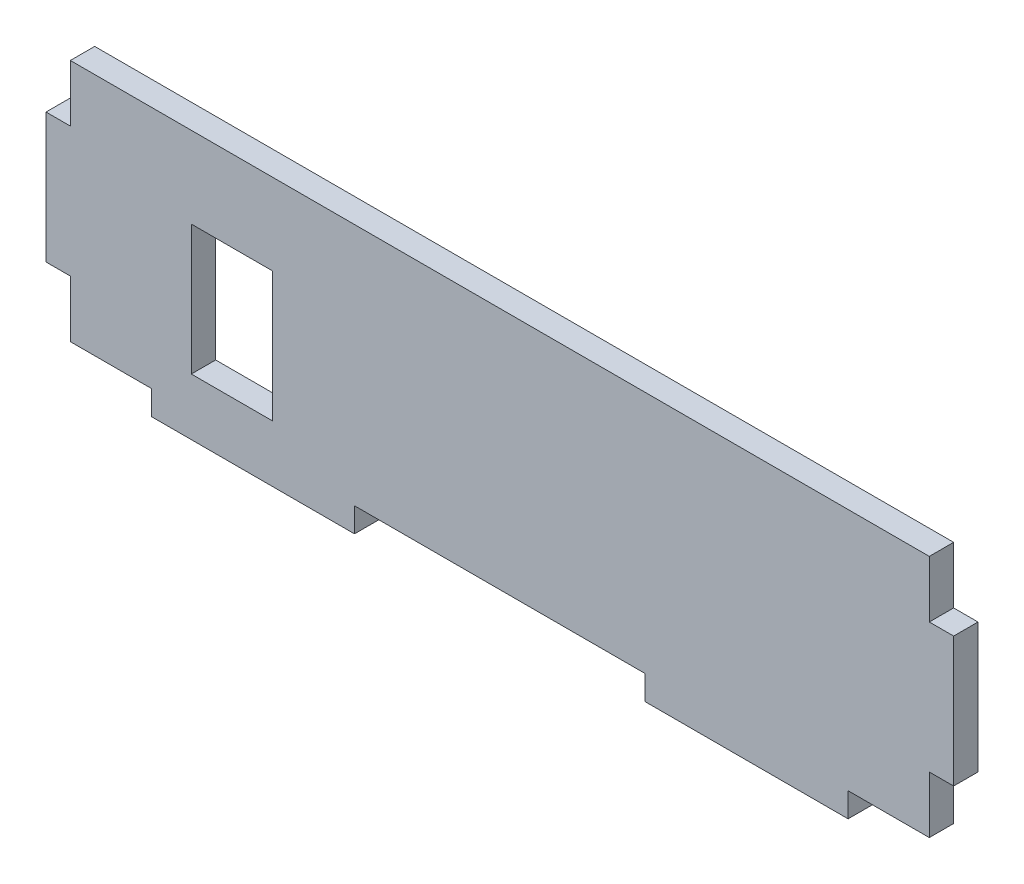
ISO-10303-21;
HEADER;
FILE_DESCRIPTION(('STEP AP214'),'2;1');
FILE_NAME('part.step','',(''),(''),'','','');
FILE_SCHEMA(('AUTOMOTIVE_DESIGN { 1 0 10303 214 1 1 1 1 }'));
ENDSEC;
DATA;
#1=APPLICATION_CONTEXT('core data for automotive mechanical design processes');
#2=APPLICATION_PROTOCOL_DEFINITION('international standard','automotive_design',2000,#1);
#3=PRODUCT_CONTEXT('',#1,'mechanical');
#4=PRODUCT('Part','Part','',(#3));
#5=PRODUCT_RELATED_PRODUCT_CATEGORY('part','',(#4));
#6=PRODUCT_DEFINITION_FORMATION('','',#4);
#7=PRODUCT_DEFINITION_CONTEXT('part definition',#1,'design');
#8=PRODUCT_DEFINITION('design','',#6,#7);
#9=PRODUCT_DEFINITION_SHAPE('','',#8);
#10=(LENGTH_UNIT() NAMED_UNIT(*) SI_UNIT(.MILLI.,.METRE.));
#11=(NAMED_UNIT(*) PLANE_ANGLE_UNIT() SI_UNIT($,.RADIAN.));
#12=(NAMED_UNIT(*) SI_UNIT($,.STERADIAN.) SOLID_ANGLE_UNIT());
#13=UNCERTAINTY_MEASURE_WITH_UNIT(LENGTH_MEASURE(1.E-05),#10,'distance_accuracy_value','');
#14=(GEOMETRIC_REPRESENTATION_CONTEXT(3) GLOBAL_UNCERTAINTY_ASSIGNED_CONTEXT((#13)) GLOBAL_UNIT_ASSIGNED_CONTEXT((#10,
#11,#12)) REPRESENTATION_CONTEXT('',''));
#15=CARTESIAN_POINT('',(0.,0.,0.));
#16=DIRECTION('',(0.,0.,1.));
#17=DIRECTION('',(1.,0.,0.));
#18=AXIS2_PLACEMENT_3D('',#15,#16,#17);
#19=CARTESIAN_POINT('',(0.,0.,3.));
#20=DIRECTION('',(0.,1.,0.));
#21=DIRECTION('',(0.,0.,1.));
#22=AXIS2_PLACEMENT_3D('',#19,#20,#21);
#23=PLANE('',#22);
#24=DIRECTION('',(1.,0.,0.));
#25=VECTOR('',#24,1.);
#26=CARTESIAN_POINT('',(0.,0.,0.));
#27=LINE('',#26,#25);
#28=CARTESIAN_POINT('',(6.50000000000001,0.,0.));
#29=VERTEX_POINT('',#28);
#30=CARTESIAN_POINT('',(16.5,0.,0.));
#31=VERTEX_POINT('',#30);
#32=EDGE_CURVE('E241',#29,#31,#27,.T.);
#33=ORIENTED_EDGE('',*,*,#32,.T.);
#34=DIRECTION('',(0.,0.,-1.));
#35=VECTOR('',#34,1.);
#36=CARTESIAN_POINT('',(16.5,0.,3.));
#37=LINE('',#36,#35);
#38=CARTESIAN_POINT('',(16.5,0.,3.));
#39=VERTEX_POINT('',#38);
#40=EDGE_CURVE('E11',#39,#31,#37,.T.);
#41=ORIENTED_EDGE('',*,*,#40,.F.);
#42=DIRECTION('',(1.,0.,0.));
#43=VECTOR('',#42,1.);
#44=CARTESIAN_POINT('',(0.,0.,3.));
#45=LINE('',#44,#43);
#46=CARTESIAN_POINT('',(6.50000000000001,0.,3.));
#47=VERTEX_POINT('',#46);
#48=EDGE_CURVE('E450',#47,#39,#45,.T.);
#49=ORIENTED_EDGE('',*,*,#48,.F.);
#50=DIRECTION('',(0.,0.,-1.));
#51=VECTOR('',#50,1.);
#52=CARTESIAN_POINT('',(6.50000000000001,0.,3.));
#53=LINE('',#52,#51);
#54=EDGE_CURVE('E296',#47,#29,#53,.T.);
#55=ORIENTED_EDGE('',*,*,#54,.T.);
#56=EDGE_LOOP('',(#33,#41,#49,#55));
#57=FACE_BOUND('',#56,.T.);
#58=ADVANCED_FACE('F35',(#57),#23,.F.);
#59=CARTESIAN_POINT('',(16.5,0.,3.));
#60=DIRECTION('',(1.,0.,0.));
#61=DIRECTION('',(0.,0.,-1.));
#62=AXIS2_PLACEMENT_3D('',#59,#60,#61);
#63=PLANE('',#62);
#64=DIRECTION('',(0.,-1.,0.));
#65=VECTOR('',#64,1.);
#66=CARTESIAN_POINT('',(16.5,0.,0.));
#67=LINE('',#66,#65);
#68=CARTESIAN_POINT('',(16.5,-3.,0.));
#69=VERTEX_POINT('',#68);
#70=EDGE_CURVE('E244',#31,#69,#67,.T.);
#71=ORIENTED_EDGE('',*,*,#70,.T.);
#72=DIRECTION('',(0.,0.,-1.));
#73=VECTOR('',#72,1.);
#74=CARTESIAN_POINT('',(16.5,-3.,3.));
#75=LINE('',#74,#73);
#76=CARTESIAN_POINT('',(16.5,-3.,3.));
#77=VERTEX_POINT('',#76);
#78=EDGE_CURVE('E45',#77,#69,#75,.T.);
#79=ORIENTED_EDGE('',*,*,#78,.F.);
#80=DIRECTION('',(0.,-1.,0.));
#81=VECTOR('',#80,1.);
#82=CARTESIAN_POINT('',(16.5,0.,3.));
#83=LINE('',#82,#81);
#84=EDGE_CURVE('E452',#39,#77,#83,.T.);
#85=ORIENTED_EDGE('',*,*,#84,.F.);
#86=ORIENTED_EDGE('',*,*,#40,.T.);
#87=EDGE_LOOP('',(#71,#79,#85,#86));
#88=FACE_BOUND('',#87,.T.);
#89=ADVANCED_FACE('F363',(#88),#63,.F.);
#90=CARTESIAN_POINT('',(0.,-3.,3.));
#91=DIRECTION('',(0.,-1.,0.));
#92=DIRECTION('',(0.,0.,-1.));
#93=AXIS2_PLACEMENT_3D('',#90,#91,#92);
#94=PLANE('',#93);
#95=DIRECTION('',(-1.,0.,0.));
#96=VECTOR('',#95,1.);
#97=CARTESIAN_POINT('',(0.,-3.,0.));
#98=LINE('',#97,#96);
#99=CARTESIAN_POINT('',(41.5,-3.,0.));
#100=VERTEX_POINT('',#99);
#101=EDGE_CURVE('E247',#100,#69,#98,.T.);
#102=ORIENTED_EDGE('',*,*,#101,.F.);
#103=DIRECTION('',(0.,0.,-1.));
#104=VECTOR('',#103,1.);
#105=CARTESIAN_POINT('',(41.5,-3.,3.));
#106=LINE('',#105,#104);
#107=CARTESIAN_POINT('',(41.5,-3.,3.));
#108=VERTEX_POINT('',#107);
#109=EDGE_CURVE('E327',#108,#100,#106,.T.);
#110=ORIENTED_EDGE('',*,*,#109,.F.);
#111=DIRECTION('',(-1.,0.,0.));
#112=VECTOR('',#111,1.);
#113=CARTESIAN_POINT('',(0.,-3.,3.));
#114=LINE('',#113,#112);
#115=EDGE_CURVE('E454',#108,#77,#114,.T.);
#116=ORIENTED_EDGE('',*,*,#115,.T.);
#117=ORIENTED_EDGE('',*,*,#78,.T.);
#118=EDGE_LOOP('',(#102,#110,#116,#117));
#119=FACE_BOUND('',#118,.T.);
#120=ADVANCED_FACE('F369',(#119),#94,.T.);
#121=CARTESIAN_POINT('',(41.5,0.,3.));
#122=DIRECTION('',(1.,0.,0.));
#123=DIRECTION('',(0.,0.,-1.));
#124=AXIS2_PLACEMENT_3D('',#121,#122,#123);
#125=PLANE('',#124);
#126=DIRECTION('',(0.,-1.,0.));
#127=VECTOR('',#126,1.);
#128=CARTESIAN_POINT('',(41.5,0.,0.));
#129=LINE('',#128,#127);
#130=CARTESIAN_POINT('',(41.5,0.,0.));
#131=VERTEX_POINT('',#130);
#132=EDGE_CURVE('E250',#131,#100,#129,.T.);
#133=ORIENTED_EDGE('',*,*,#132,.F.);
#134=DIRECTION('',(0.,0.,-1.));
#135=VECTOR('',#134,1.);
#136=CARTESIAN_POINT('',(41.5,0.,3.));
#137=LINE('',#136,#135);
#138=CARTESIAN_POINT('',(41.5,0.,3.));
#139=VERTEX_POINT('',#138);
#140=EDGE_CURVE('E325',#139,#131,#137,.T.);
#141=ORIENTED_EDGE('',*,*,#140,.F.);
#142=DIRECTION('',(0.,-1.,0.));
#143=VECTOR('',#142,1.);
#144=CARTESIAN_POINT('',(41.5,0.,3.));
#145=LINE('',#144,#143);
#146=EDGE_CURVE('E457',#139,#108,#145,.T.);
#147=ORIENTED_EDGE('',*,*,#146,.T.);
#148=ORIENTED_EDGE('',*,*,#109,.T.);
#149=EDGE_LOOP('',(#133,#141,#147,#148));
#150=FACE_BOUND('',#149,.T.);
#151=ADVANCED_FACE('F375',(#150),#125,.T.);
#152=CARTESIAN_POINT('',(0.,0.,3.));
#153=DIRECTION('',(0.,-1.,0.));
#154=DIRECTION('',(0.,0.,-1.));
#155=AXIS2_PLACEMENT_3D('',#152,#153,#154);
#156=PLANE('',#155);
#157=DIRECTION('',(-1.,0.,0.));
#158=VECTOR('',#157,1.);
#159=CARTESIAN_POINT('',(0.,0.,0.));
#160=LINE('',#159,#158);
#161=CARTESIAN_POINT('',(77.3,0.,0.));
#162=VERTEX_POINT('',#161);
#163=EDGE_CURVE('E253',#162,#131,#160,.T.);
#164=ORIENTED_EDGE('',*,*,#163,.F.);
#165=DIRECTION('',(0.,0.,-1.));
#166=VECTOR('',#165,1.);
#167=CARTESIAN_POINT('',(77.3,0.,3.));
#168=LINE('',#167,#166);
#169=CARTESIAN_POINT('',(77.3,0.,3.));
#170=VERTEX_POINT('',#169);
#171=EDGE_CURVE('E323',#170,#162,#168,.T.);
#172=ORIENTED_EDGE('',*,*,#171,.F.);
#173=DIRECTION('',(-1.,0.,0.));
#174=VECTOR('',#173,1.);
#175=CARTESIAN_POINT('',(0.,0.,3.));
#176=LINE('',#175,#174);
#177=EDGE_CURVE('E460',#170,#139,#176,.T.);
#178=ORIENTED_EDGE('',*,*,#177,.T.);
#179=ORIENTED_EDGE('',*,*,#140,.T.);
#180=EDGE_LOOP('',(#164,#172,#178,#179));
#181=FACE_BOUND('',#180,.T.);
#182=ADVANCED_FACE('F379',(#181),#156,.T.);
#183=CARTESIAN_POINT('',(77.3,0.,3.));
#184=DIRECTION('',(1.,0.,0.));
#185=DIRECTION('',(0.,0.,-1.));
#186=AXIS2_PLACEMENT_3D('',#183,#184,#185);
#187=PLANE('',#186);
#188=DIRECTION('',(0.,-1.,0.));
#189=VECTOR('',#188,1.);
#190=CARTESIAN_POINT('',(77.3,0.,0.));
#191=LINE('',#190,#189);
#192=CARTESIAN_POINT('',(77.3,-3.,0.));
#193=VERTEX_POINT('',#192);
#194=EDGE_CURVE('E256',#162,#193,#191,.T.);
#195=ORIENTED_EDGE('',*,*,#194,.T.);
#196=DIRECTION('',(0.,0.,-1.));
#197=VECTOR('',#196,1.);
#198=CARTESIAN_POINT('',(77.3,-3.,3.));
#199=LINE('',#198,#197);
#200=CARTESIAN_POINT('',(77.3,-3.,3.));
#201=VERTEX_POINT('',#200);
#202=EDGE_CURVE('E320',#201,#193,#199,.T.);
#203=ORIENTED_EDGE('',*,*,#202,.F.);
#204=DIRECTION('',(0.,-1.,0.));
#205=VECTOR('',#204,1.);
#206=CARTESIAN_POINT('',(77.3,0.,3.));
#207=LINE('',#206,#205);
#208=EDGE_CURVE('E463',#170,#201,#207,.T.);
#209=ORIENTED_EDGE('',*,*,#208,.F.);
#210=ORIENTED_EDGE('',*,*,#171,.T.);
#211=EDGE_LOOP('',(#195,#203,#209,#210));
#212=FACE_BOUND('',#211,.T.);
#213=ADVANCED_FACE('F383',(#212),#187,.F.);
#214=CARTESIAN_POINT('',(0.,-3.,3.));
#215=DIRECTION('',(0.,1.,0.));
#216=DIRECTION('',(0.,0.,1.));
#217=AXIS2_PLACEMENT_3D('',#214,#215,#216);
#218=PLANE('',#217);
#219=DIRECTION('',(1.,0.,0.));
#220=VECTOR('',#219,1.);
#221=CARTESIAN_POINT('',(0.,-3.,0.));
#222=LINE('',#221,#220);
#223=CARTESIAN_POINT('',(102.3,-3.,0.));
#224=VERTEX_POINT('',#223);
#225=EDGE_CURVE('E258',#193,#224,#222,.T.);
#226=ORIENTED_EDGE('',*,*,#225,.T.);
#227=DIRECTION('',(0.,0.,-1.));
#228=VECTOR('',#227,1.);
#229=CARTESIAN_POINT('',(102.3,-3.,3.));
#230=LINE('',#229,#228);
#231=CARTESIAN_POINT('',(102.3,-3.,3.));
#232=VERTEX_POINT('',#231);
#233=EDGE_CURVE('E318',#232,#224,#230,.T.);
#234=ORIENTED_EDGE('',*,*,#233,.F.);
#235=DIRECTION('',(1.,0.,0.));
#236=VECTOR('',#235,1.);
#237=CARTESIAN_POINT('',(0.,-3.,3.));
#238=LINE('',#237,#236);
#239=EDGE_CURVE('E465',#201,#232,#238,.T.);
#240=ORIENTED_EDGE('',*,*,#239,.F.);
#241=ORIENTED_EDGE('',*,*,#202,.T.);
#242=EDGE_LOOP('',(#226,#234,#240,#241));
#243=FACE_BOUND('',#242,.T.);
#244=ADVANCED_FACE('F387',(#243),#218,.F.);
#245=CARTESIAN_POINT('',(102.3,0.,3.));
#246=DIRECTION('',(1.,0.,0.));
#247=DIRECTION('',(0.,0.,-1.));
#248=AXIS2_PLACEMENT_3D('',#245,#246,#247);
#249=PLANE('',#248);
#250=DIRECTION('',(0.,-1.,0.));
#251=VECTOR('',#250,1.);
#252=CARTESIAN_POINT('',(102.3,0.,0.));
#253=LINE('',#252,#251);
#254=CARTESIAN_POINT('',(102.3,0.,0.));
#255=VERTEX_POINT('',#254);
#256=EDGE_CURVE('E261',#255,#224,#253,.T.);
#257=ORIENTED_EDGE('',*,*,#256,.F.);
#258=DIRECTION('',(0.,0.,-1.));
#259=VECTOR('',#258,1.);
#260=CARTESIAN_POINT('',(102.3,0.,3.));
#261=LINE('',#260,#259);
#262=CARTESIAN_POINT('',(102.3,0.,3.));
#263=VERTEX_POINT('',#262);
#264=EDGE_CURVE('E316',#263,#255,#261,.T.);
#265=ORIENTED_EDGE('',*,*,#264,.F.);
#266=DIRECTION('',(0.,-1.,0.));
#267=VECTOR('',#266,1.);
#268=CARTESIAN_POINT('',(102.3,0.,3.));
#269=LINE('',#268,#267);
#270=EDGE_CURVE('E467',#263,#232,#269,.T.);
#271=ORIENTED_EDGE('',*,*,#270,.T.);
#272=ORIENTED_EDGE('',*,*,#233,.T.);
#273=EDGE_LOOP('',(#257,#265,#271,#272));
#274=FACE_BOUND('',#273,.T.);
#275=ADVANCED_FACE('F391',(#274),#249,.T.);
#276=CARTESIAN_POINT('',(0.,0.,3.));
#277=DIRECTION('',(0.,1.,0.));
#278=DIRECTION('',(0.,0.,1.));
#279=AXIS2_PLACEMENT_3D('',#276,#277,#278);
#280=PLANE('',#279);
#281=DIRECTION('',(1.,0.,0.));
#282=VECTOR('',#281,1.);
#283=CARTESIAN_POINT('',(0.,0.,0.));
#284=LINE('',#283,#282);
#285=CARTESIAN_POINT('',(112.3,0.,0.));
#286=VERTEX_POINT('',#285);
#287=EDGE_CURVE('E264',#255,#286,#284,.T.);
#288=ORIENTED_EDGE('',*,*,#287,.T.);
#289=DIRECTION('',(0.,0.,-1.));
#290=VECTOR('',#289,1.);
#291=CARTESIAN_POINT('',(112.3,0.,3.));
#292=LINE('',#291,#290);
#293=CARTESIAN_POINT('',(112.3,0.,3.));
#294=VERTEX_POINT('',#293);
#295=EDGE_CURVE('E314',#294,#286,#292,.T.);
#296=ORIENTED_EDGE('',*,*,#295,.F.);
#297=DIRECTION('',(1.,0.,0.));
#298=VECTOR('',#297,1.);
#299=CARTESIAN_POINT('',(0.,0.,3.));
#300=LINE('',#299,#298);
#301=EDGE_CURVE('E470',#263,#294,#300,.T.);
#302=ORIENTED_EDGE('',*,*,#301,.F.);
#303=ORIENTED_EDGE('',*,*,#264,.T.);
#304=EDGE_LOOP('',(#288,#296,#302,#303));
#305=FACE_BOUND('',#304,.T.);
#306=ADVANCED_FACE('F395',(#305),#280,.F.);
#307=CARTESIAN_POINT('',(112.3,0.,3.));
#308=DIRECTION('',(1.,0.,0.));
#309=DIRECTION('',(0.,0.,-1.));
#310=AXIS2_PLACEMENT_3D('',#307,#308,#309);
#311=PLANE('',#310);
#312=DIRECTION('',(0.,-1.,0.));
#313=VECTOR('',#312,1.);
#314=CARTESIAN_POINT('',(112.3,0.,0.));
#315=LINE('',#314,#313);
#316=CARTESIAN_POINT('',(112.3,7.,0.));
#317=VERTEX_POINT('',#316);
#318=EDGE_CURVE('E267',#317,#286,#315,.T.);
#319=ORIENTED_EDGE('',*,*,#318,.F.);
#320=DIRECTION('',(0.,0.,-1.));
#321=VECTOR('',#320,1.);
#322=CARTESIAN_POINT('',(112.3,7.,3.));
#323=LINE('',#322,#321);
#324=CARTESIAN_POINT('',(112.3,7.,3.));
#325=VERTEX_POINT('',#324);
#326=EDGE_CURVE('E312',#325,#317,#323,.T.);
#327=ORIENTED_EDGE('',*,*,#326,.F.);
#328=DIRECTION('',(0.,-1.,0.));
#329=VECTOR('',#328,1.);
#330=CARTESIAN_POINT('',(112.3,0.,3.));
#331=LINE('',#330,#329);
#332=EDGE_CURVE('E472',#325,#294,#331,.T.);
#333=ORIENTED_EDGE('',*,*,#332,.T.);
#334=ORIENTED_EDGE('',*,*,#295,.T.);
#335=EDGE_LOOP('',(#319,#327,#333,#334));
#336=FACE_BOUND('',#335,.T.);
#337=ADVANCED_FACE('F399',(#336),#311,.T.);
#338=CARTESIAN_POINT('',(0.,7.,3.));
#339=DIRECTION('',(0.,1.,0.));
#340=DIRECTION('',(0.,0.,1.));
#341=AXIS2_PLACEMENT_3D('',#338,#339,#340);
#342=PLANE('',#341);
#343=DIRECTION('',(1.,0.,0.));
#344=VECTOR('',#343,1.);
#345=CARTESIAN_POINT('',(0.,7.,0.));
#346=LINE('',#345,#344);
#347=CARTESIAN_POINT('',(115.3,7.,0.));
#348=VERTEX_POINT('',#347);
#349=EDGE_CURVE('E270',#317,#348,#346,.T.);
#350=ORIENTED_EDGE('',*,*,#349,.T.);
#351=DIRECTION('',(0.,0.,-1.));
#352=VECTOR('',#351,1.);
#353=CARTESIAN_POINT('',(115.3,7.,3.));
#354=LINE('',#353,#352);
#355=CARTESIAN_POINT('',(115.3,7.,3.));
#356=VERTEX_POINT('',#355);
#357=EDGE_CURVE('E310',#356,#348,#354,.T.);
#358=ORIENTED_EDGE('',*,*,#357,.F.);
#359=DIRECTION('',(1.,0.,0.));
#360=VECTOR('',#359,1.);
#361=CARTESIAN_POINT('',(0.,7.,3.));
#362=LINE('',#361,#360);
#363=EDGE_CURVE('E475',#325,#356,#362,.T.);
#364=ORIENTED_EDGE('',*,*,#363,.F.);
#365=ORIENTED_EDGE('',*,*,#326,.T.);
#366=EDGE_LOOP('',(#350,#358,#364,#365));
#367=FACE_BOUND('',#366,.T.);
#368=ADVANCED_FACE('F403',(#367),#342,.F.);
#369=CARTESIAN_POINT('',(115.3,0.,3.));
#370=DIRECTION('',(1.,0.,0.));
#371=DIRECTION('',(0.,0.,-1.));
#372=AXIS2_PLACEMENT_3D('',#369,#370,#371);
#373=PLANE('',#372);
#374=DIRECTION('',(0.,-1.,0.));
#375=VECTOR('',#374,1.);
#376=CARTESIAN_POINT('',(115.3,0.,0.));
#377=LINE('',#376,#375);
#378=CARTESIAN_POINT('',(115.3,23.,0.));
#379=VERTEX_POINT('',#378);
#380=EDGE_CURVE('E273',#379,#348,#377,.T.);
#381=ORIENTED_EDGE('',*,*,#380,.F.);
#382=DIRECTION('',(0.,0.,-1.));
#383=VECTOR('',#382,1.);
#384=CARTESIAN_POINT('',(115.3,23.,3.));
#385=LINE('',#384,#383);
#386=CARTESIAN_POINT('',(115.3,23.,3.));
#387=VERTEX_POINT('',#386);
#388=EDGE_CURVE('E308',#387,#379,#385,.T.);
#389=ORIENTED_EDGE('',*,*,#388,.F.);
#390=DIRECTION('',(0.,-1.,0.));
#391=VECTOR('',#390,1.);
#392=CARTESIAN_POINT('',(115.3,0.,3.));
#393=LINE('',#392,#391);
#394=EDGE_CURVE('E477',#387,#356,#393,.T.);
#395=ORIENTED_EDGE('',*,*,#394,.T.);
#396=ORIENTED_EDGE('',*,*,#357,.T.);
#397=EDGE_LOOP('',(#381,#389,#395,#396));
#398=FACE_BOUND('',#397,.T.);
#399=ADVANCED_FACE('F407',(#398),#373,.T.);
#400=CARTESIAN_POINT('',(0.,23.,3.));
#401=DIRECTION('',(0.,1.,0.));
#402=DIRECTION('',(0.,0.,1.));
#403=AXIS2_PLACEMENT_3D('',#400,#401,#402);
#404=PLANE('',#403);
#405=DIRECTION('',(1.,0.,0.));
#406=VECTOR('',#405,1.);
#407=CARTESIAN_POINT('',(0.,23.,0.));
#408=LINE('',#407,#406);
#409=CARTESIAN_POINT('',(112.3,23.,0.));
#410=VERTEX_POINT('',#409);
#411=EDGE_CURVE('E276',#410,#379,#408,.T.);
#412=ORIENTED_EDGE('',*,*,#411,.F.);
#413=DIRECTION('',(0.,0.,-1.));
#414=VECTOR('',#413,1.);
#415=CARTESIAN_POINT('',(112.3,23.,3.));
#416=LINE('',#415,#414);
#417=CARTESIAN_POINT('',(112.3,23.,3.));
#418=VERTEX_POINT('',#417);
#419=EDGE_CURVE('E306',#418,#410,#416,.T.);
#420=ORIENTED_EDGE('',*,*,#419,.F.);
#421=DIRECTION('',(1.,0.,0.));
#422=VECTOR('',#421,1.);
#423=CARTESIAN_POINT('',(0.,23.,3.));
#424=LINE('',#423,#422);
#425=EDGE_CURVE('E480',#418,#387,#424,.T.);
#426=ORIENTED_EDGE('',*,*,#425,.T.);
#427=ORIENTED_EDGE('',*,*,#388,.T.);
#428=EDGE_LOOP('',(#412,#420,#426,#427));
#429=FACE_BOUND('',#428,.T.);
#430=ADVANCED_FACE('F411',(#429),#404,.T.);
#431=CARTESIAN_POINT('',(112.3,0.,3.));
#432=DIRECTION('',(-1.,0.,0.));
#433=DIRECTION('',(0.,0.,1.));
#434=AXIS2_PLACEMENT_3D('',#431,#432,#433);
#435=PLANE('',#434);
#436=DIRECTION('',(0.,1.,0.));
#437=VECTOR('',#436,1.);
#438=CARTESIAN_POINT('',(112.3,0.,0.));
#439=LINE('',#438,#437);
#440=CARTESIAN_POINT('',(112.3,30.,0.));
#441=VERTEX_POINT('',#440);
#442=EDGE_CURVE('E279',#410,#441,#439,.T.);
#443=ORIENTED_EDGE('',*,*,#442,.T.);
#444=DIRECTION('',(0.,0.,-1.));
#445=VECTOR('',#444,1.);
#446=CARTESIAN_POINT('',(112.3,30.,3.));
#447=LINE('',#446,#445);
#448=CARTESIAN_POINT('',(112.3,30.,3.));
#449=VERTEX_POINT('',#448);
#450=EDGE_CURVE('E304',#449,#441,#447,.T.);
#451=ORIENTED_EDGE('',*,*,#450,.F.);
#452=DIRECTION('',(0.,1.,0.));
#453=VECTOR('',#452,1.);
#454=CARTESIAN_POINT('',(112.3,0.,3.));
#455=LINE('',#454,#453);
#456=EDGE_CURVE('E483',#418,#449,#455,.T.);
#457=ORIENTED_EDGE('',*,*,#456,.F.);
#458=ORIENTED_EDGE('',*,*,#419,.T.);
#459=EDGE_LOOP('',(#443,#451,#457,#458));
#460=FACE_BOUND('',#459,.T.);
#461=ADVANCED_FACE('F415',(#460),#435,.F.);
#462=CARTESIAN_POINT('',(0.,30.,3.));
#463=DIRECTION('',(0.,1.,0.));
#464=DIRECTION('',(0.,0.,1.));
#465=AXIS2_PLACEMENT_3D('',#462,#463,#464);
#466=PLANE('',#465);
#467=DIRECTION('',(1.,0.,0.));
#468=VECTOR('',#467,1.);
#469=CARTESIAN_POINT('',(0.,30.,0.));
#470=LINE('',#469,#468);
#471=CARTESIAN_POINT('',(6.50000000000001,30.,0.));
#472=VERTEX_POINT('',#471);
#473=EDGE_CURVE('E282',#472,#441,#470,.T.);
#474=ORIENTED_EDGE('',*,*,#473,.F.);
#475=DIRECTION('',(0.,0.,-1.));
#476=VECTOR('',#475,1.);
#477=CARTESIAN_POINT('',(6.50000000000001,30.,3.));
#478=LINE('',#477,#476);
#479=CARTESIAN_POINT('',(6.50000000000001,30.,3.));
#480=VERTEX_POINT('',#479);
#481=EDGE_CURVE('E302',#480,#472,#478,.T.);
#482=ORIENTED_EDGE('',*,*,#481,.F.);
#483=DIRECTION('',(1.,0.,0.));
#484=VECTOR('',#483,1.);
#485=CARTESIAN_POINT('',(0.,30.,3.));
#486=LINE('',#485,#484);
#487=EDGE_CURVE('E485',#480,#449,#486,.T.);
#488=ORIENTED_EDGE('',*,*,#487,.T.);
#489=ORIENTED_EDGE('',*,*,#450,.T.);
#490=EDGE_LOOP('',(#474,#482,#488,#489));
#491=FACE_BOUND('',#490,.T.);
#492=ADVANCED_FACE('F419',(#491),#466,.T.);
#493=CARTESIAN_POINT('',(6.50000000000001,0.,3.));
#494=DIRECTION('',(-1.,0.,0.));
#495=DIRECTION('',(0.,0.,1.));
#496=AXIS2_PLACEMENT_3D('',#493,#494,#495);
#497=PLANE('',#496);
#498=DIRECTION('',(0.,1.,0.));
#499=VECTOR('',#498,1.);
#500=CARTESIAN_POINT('',(6.50000000000001,0.,0.));
#501=LINE('',#500,#499);
#502=CARTESIAN_POINT('',(6.50000000000001,23.,0.));
#503=VERTEX_POINT('',#502);
#504=EDGE_CURVE('E285',#503,#472,#501,.T.);
#505=ORIENTED_EDGE('',*,*,#504,.F.);
#506=DIRECTION('',(0.,0.,-1.));
#507=VECTOR('',#506,1.);
#508=CARTESIAN_POINT('',(6.50000000000001,23.,3.));
#509=LINE('',#508,#507);
#510=CARTESIAN_POINT('',(6.50000000000001,23.,3.));
#511=VERTEX_POINT('',#510);
#512=EDGE_CURVE('E300',#511,#503,#509,.T.);
#513=ORIENTED_EDGE('',*,*,#512,.F.);
#514=DIRECTION('',(0.,1.,0.));
#515=VECTOR('',#514,1.);
#516=CARTESIAN_POINT('',(6.50000000000001,0.,3.));
#517=LINE('',#516,#515);
#518=EDGE_CURVE('E488',#511,#480,#517,.T.);
#519=ORIENTED_EDGE('',*,*,#518,.T.);
#520=ORIENTED_EDGE('',*,*,#481,.T.);
#521=EDGE_LOOP('',(#505,#513,#519,#520));
#522=FACE_BOUND('',#521,.T.);
#523=ADVANCED_FACE('F423',(#522),#497,.T.);
#524=CARTESIAN_POINT('',(0.,23.,3.));
#525=DIRECTION('',(0.,-1.,0.));
#526=DIRECTION('',(0.,0.,-1.));
#527=AXIS2_PLACEMENT_3D('',#524,#525,#526);
#528=PLANE('',#527);
#529=DIRECTION('',(-1.,0.,0.));
#530=VECTOR('',#529,1.);
#531=CARTESIAN_POINT('',(0.,23.,0.));
#532=LINE('',#531,#530);
#533=CARTESIAN_POINT('',(3.50000000000001,23.,0.));
#534=VERTEX_POINT('',#533);
#535=EDGE_CURVE('E288',#503,#534,#532,.T.);
#536=ORIENTED_EDGE('',*,*,#535,.T.);
#537=DIRECTION('',(0.,0.,-1.));
#538=VECTOR('',#537,1.);
#539=CARTESIAN_POINT('',(3.50000000000001,23.,3.));
#540=LINE('',#539,#538);
#541=CARTESIAN_POINT('',(3.50000000000001,23.,3.));
#542=VERTEX_POINT('',#541);
#543=EDGE_CURVE('E215',#542,#534,#540,.T.);
#544=ORIENTED_EDGE('',*,*,#543,.F.);
#545=DIRECTION('',(-1.,0.,0.));
#546=VECTOR('',#545,1.);
#547=CARTESIAN_POINT('',(0.,23.,3.));
#548=LINE('',#547,#546);
#549=EDGE_CURVE('E221',#511,#542,#548,.T.);
#550=ORIENTED_EDGE('',*,*,#549,.F.);
#551=ORIENTED_EDGE('',*,*,#512,.T.);
#552=EDGE_LOOP('',(#536,#544,#550,#551));
#553=FACE_BOUND('',#552,.T.);
#554=ADVANCED_FACE('F427',(#553),#528,.F.);
#555=CARTESIAN_POINT('',(3.50000000000001,0.,3.));
#556=DIRECTION('',(-1.,0.,0.));
#557=DIRECTION('',(0.,0.,1.));
#558=AXIS2_PLACEMENT_3D('',#555,#556,#557);
#559=PLANE('',#558);
#560=DIRECTION('',(0.,1.,0.));
#561=VECTOR('',#560,1.);
#562=CARTESIAN_POINT('',(3.50000000000001,0.,0.));
#563=LINE('',#562,#561);
#564=CARTESIAN_POINT('',(3.50000000000001,7.,0.));
#565=VERTEX_POINT('',#564);
#566=EDGE_CURVE('E210',#565,#534,#563,.T.);
#567=ORIENTED_EDGE('',*,*,#566,.F.);
#568=DIRECTION('',(0.,0.,-1.));
#569=VECTOR('',#568,1.);
#570=CARTESIAN_POINT('',(3.50000000000001,7.,3.));
#571=LINE('',#570,#569);
#572=CARTESIAN_POINT('',(3.50000000000001,7.,3.));
#573=VERTEX_POINT('',#572);
#574=EDGE_CURVE('E205',#573,#565,#571,.T.);
#575=ORIENTED_EDGE('',*,*,#574,.F.);
#576=DIRECTION('',(0.,1.,0.));
#577=VECTOR('',#576,1.);
#578=CARTESIAN_POINT('',(3.50000000000001,0.,3.));
#579=LINE('',#578,#577);
#580=EDGE_CURVE('E208',#573,#542,#579,.T.);
#581=ORIENTED_EDGE('',*,*,#580,.T.);
#582=ORIENTED_EDGE('',*,*,#543,.T.);
#583=EDGE_LOOP('',(#567,#575,#581,#582));
#584=FACE_BOUND('',#583,.T.);
#585=ADVANCED_FACE('F207',(#584),#559,.T.);
#586=CARTESIAN_POINT('',(0.,7.,3.));
#587=DIRECTION('',(0.,-1.,0.));
#588=DIRECTION('',(0.,0.,-1.));
#589=AXIS2_PLACEMENT_3D('',#586,#587,#588);
#590=PLANE('',#589);
#591=DIRECTION('',(-1.,0.,0.));
#592=VECTOR('',#591,1.);
#593=CARTESIAN_POINT('',(0.,7.,0.));
#594=LINE('',#593,#592);
#595=CARTESIAN_POINT('',(6.50000000000001,7.,0.));
#596=VERTEX_POINT('',#595);
#597=EDGE_CURVE('E292',#596,#565,#594,.T.);
#598=ORIENTED_EDGE('',*,*,#597,.F.);
#599=DIRECTION('',(0.,0.,-1.));
#600=VECTOR('',#599,1.);
#601=CARTESIAN_POINT('',(6.50000000000001,7.,3.));
#602=LINE('',#601,#600);
#603=CARTESIAN_POINT('',(6.50000000000001,7.,3.));
#604=VERTEX_POINT('',#603);
#605=EDGE_CURVE('E130',#604,#596,#602,.T.);
#606=ORIENTED_EDGE('',*,*,#605,.F.);
#607=DIRECTION('',(-1.,0.,0.));
#608=VECTOR('',#607,1.);
#609=CARTESIAN_POINT('',(0.,7.,3.));
#610=LINE('',#609,#608);
#611=EDGE_CURVE('E218',#604,#573,#610,.T.);
#612=ORIENTED_EDGE('',*,*,#611,.T.);
#613=ORIENTED_EDGE('',*,*,#574,.T.);
#614=EDGE_LOOP('',(#598,#606,#612,#613));
#615=FACE_BOUND('',#614,.T.);
#616=ADVANCED_FACE('F224',(#615),#590,.T.);
#617=CARTESIAN_POINT('',(0.,4.,3.));
#618=DIRECTION('',(0.,1.,0.));
#619=DIRECTION('',(0.,0.,1.));
#620=AXIS2_PLACEMENT_3D('',#617,#618,#619);
#621=PLANE('',#620);
#622=DIRECTION('',(1.,0.,0.));
#623=VECTOR('',#622,1.);
#624=CARTESIAN_POINT('',(0.,4.,0.));
#625=LINE('',#624,#623);
#626=CARTESIAN_POINT('',(21.4,4.,0.));
#627=VERTEX_POINT('',#626);
#628=CARTESIAN_POINT('',(31.4,4.,0.));
#629=VERTEX_POINT('',#628);
#630=EDGE_CURVE('E230',#627,#629,#625,.T.);
#631=ORIENTED_EDGE('',*,*,#630,.F.);
#632=DIRECTION('',(0.,0.,-1.));
#633=VECTOR('',#632,1.);
#634=CARTESIAN_POINT('',(21.4,4.,3.));
#635=LINE('',#634,#633);
#636=CARTESIAN_POINT('',(21.4,4.,3.));
#637=VERTEX_POINT('',#636);
#638=EDGE_CURVE('E39',#637,#627,#635,.T.);
#639=ORIENTED_EDGE('',*,*,#638,.F.);
#640=DIRECTION('',(1.,0.,0.));
#641=VECTOR('',#640,1.);
#642=CARTESIAN_POINT('',(0.,4.,3.));
#643=LINE('',#642,#641);
#644=CARTESIAN_POINT('',(31.4,4.,3.));
#645=VERTEX_POINT('',#644);
#646=EDGE_CURVE('E295',#637,#645,#643,.T.);
#647=ORIENTED_EDGE('',*,*,#646,.T.);
#648=DIRECTION('',(0.,0.,-1.));
#649=VECTOR('',#648,1.);
#650=CARTESIAN_POINT('',(31.4,4.,3.));
#651=LINE('',#650,#649);
#652=EDGE_CURVE('E226',#645,#629,#651,.T.);
#653=ORIENTED_EDGE('',*,*,#652,.T.);
#654=EDGE_LOOP('',(#631,#639,#647,#653));
#655=FACE_BOUND('',#654,.T.);
#656=ADVANCED_FACE('F37',(#655),#621,.T.);
#657=CARTESIAN_POINT('',(21.4,0.,3.));
#658=DIRECTION('',(-1.,0.,0.));
#659=DIRECTION('',(0.,0.,1.));
#660=AXIS2_PLACEMENT_3D('',#657,#658,#659);
#661=PLANE('',#660);
#662=DIRECTION('',(0.,1.,0.));
#663=VECTOR('',#662,1.);
#664=CARTESIAN_POINT('',(21.4,0.,0.));
#665=LINE('',#664,#663);
#666=CARTESIAN_POINT('',(21.4,20.,0.));
#667=VERTEX_POINT('',#666);
#668=EDGE_CURVE('E233',#627,#667,#665,.T.);
#669=ORIENTED_EDGE('',*,*,#668,.T.);
#670=DIRECTION('',(0.,0.,-1.));
#671=VECTOR('',#670,1.);
#672=CARTESIAN_POINT('',(21.4,20.,3.));
#673=LINE('',#672,#671);
#674=CARTESIAN_POINT('',(21.4,20.,3.));
#675=VERTEX_POINT('',#674);
#676=EDGE_CURVE('E332',#675,#667,#673,.T.);
#677=ORIENTED_EDGE('',*,*,#676,.F.);
#678=DIRECTION('',(0.,1.,0.));
#679=VECTOR('',#678,1.);
#680=CARTESIAN_POINT('',(21.4,0.,3.));
#681=LINE('',#680,#679);
#682=EDGE_CURVE('E341',#637,#675,#681,.T.);
#683=ORIENTED_EDGE('',*,*,#682,.F.);
#684=ORIENTED_EDGE('',*,*,#638,.T.);
#685=EDGE_LOOP('',(#669,#677,#683,#684));
#686=FACE_BOUND('',#685,.T.);
#687=ADVANCED_FACE('F340',(#686),#661,.F.);
#688=CARTESIAN_POINT('',(0.,20.,3.));
#689=DIRECTION('',(0.,1.,0.));
#690=DIRECTION('',(0.,0.,1.));
#691=AXIS2_PLACEMENT_3D('',#688,#689,#690);
#692=PLANE('',#691);
#693=DIRECTION('',(1.,0.,0.));
#694=VECTOR('',#693,1.);
#695=CARTESIAN_POINT('',(0.,20.,0.));
#696=LINE('',#695,#694);
#697=CARTESIAN_POINT('',(31.4,20.,0.));
#698=VERTEX_POINT('',#697);
#699=EDGE_CURVE('E235',#667,#698,#696,.T.);
#700=ORIENTED_EDGE('',*,*,#699,.T.);
#701=DIRECTION('',(0.,0.,-1.));
#702=VECTOR('',#701,1.);
#703=CARTESIAN_POINT('',(31.4,20.,3.));
#704=LINE('',#703,#702);
#705=CARTESIAN_POINT('',(31.4,20.,3.));
#706=VERTEX_POINT('',#705);
#707=EDGE_CURVE('E331',#706,#698,#704,.T.);
#708=ORIENTED_EDGE('',*,*,#707,.F.);
#709=DIRECTION('',(1.,0.,0.));
#710=VECTOR('',#709,1.);
#711=CARTESIAN_POINT('',(0.,20.,3.));
#712=LINE('',#711,#710);
#713=EDGE_CURVE('E445',#675,#706,#712,.T.);
#714=ORIENTED_EDGE('',*,*,#713,.F.);
#715=ORIENTED_EDGE('',*,*,#676,.T.);
#716=EDGE_LOOP('',(#700,#708,#714,#715));
#717=FACE_BOUND('',#716,.T.);
#718=ADVANCED_FACE('F353',(#717),#692,.F.);
#719=CARTESIAN_POINT('',(31.4,0.,3.));
#720=DIRECTION('',(-1.,0.,0.));
#721=DIRECTION('',(0.,0.,1.));
#722=AXIS2_PLACEMENT_3D('',#719,#720,#721);
#723=PLANE('',#722);
#724=DIRECTION('',(0.,1.,0.));
#725=VECTOR('',#724,1.);
#726=CARTESIAN_POINT('',(31.4,0.,0.));
#727=LINE('',#726,#725);
#728=EDGE_CURVE('E238',#629,#698,#727,.T.);
#729=ORIENTED_EDGE('',*,*,#728,.F.);
#730=ORIENTED_EDGE('',*,*,#652,.F.);
#731=DIRECTION('',(0.,1.,0.));
#732=VECTOR('',#731,1.);
#733=CARTESIAN_POINT('',(31.4,0.,3.));
#734=LINE('',#733,#732);
#735=EDGE_CURVE('E351',#645,#706,#734,.T.);
#736=ORIENTED_EDGE('',*,*,#735,.T.);
#737=ORIENTED_EDGE('',*,*,#707,.T.);
#738=EDGE_LOOP('',(#729,#730,#736,#737));
#739=FACE_BOUND('',#738,.T.);
#740=ADVANCED_FACE('F350',(#739),#723,.T.);
#741=CARTESIAN_POINT('',(6.50000000000001,0.,3.));
#742=DIRECTION('',(1.,0.,0.));
#743=DIRECTION('',(0.,0.,-1.));
#744=AXIS2_PLACEMENT_3D('',#741,#742,#743);
#745=PLANE('',#744);
#746=DIRECTION('',(0.,-1.,0.));
#747=VECTOR('',#746,1.);
#748=CARTESIAN_POINT('',(6.50000000000001,0.,0.));
#749=LINE('',#748,#747);
#750=EDGE_CURVE('E133',#596,#29,#749,.T.);
#751=ORIENTED_EDGE('',*,*,#750,.T.);
#752=ORIENTED_EDGE('',*,*,#54,.F.);
#753=DIRECTION('',(0.,-1.,0.));
#754=VECTOR('',#753,1.);
#755=CARTESIAN_POINT('',(6.50000000000001,0.,3.));
#756=LINE('',#755,#754);
#757=EDGE_CURVE('E54',#604,#47,#756,.T.);
#758=ORIENTED_EDGE('',*,*,#757,.F.);
#759=ORIENTED_EDGE('',*,*,#605,.T.);
#760=EDGE_LOOP('',(#751,#752,#758,#759));
#761=FACE_BOUND('',#760,.T.);
#762=ADVANCED_FACE('F360',(#761),#745,.F.);
#763=CARTESIAN_POINT('',(0.,0.,3.));
#764=DIRECTION('',(0.,0.,1.));
#765=DIRECTION('',(1.,0.,0.));
#766=AXIS2_PLACEMENT_3D('',#763,#764,#765);
#767=PLANE('',#766);
#768=ORIENTED_EDGE('',*,*,#646,.F.);
#769=ORIENTED_EDGE('',*,*,#682,.T.);
#770=ORIENTED_EDGE('',*,*,#713,.T.);
#771=ORIENTED_EDGE('',*,*,#735,.F.);
#772=EDGE_LOOP('',(#768,#769,#770,#771));
#773=FACE_BOUND('',#772,.T.);
#774=ORIENTED_EDGE('',*,*,#48,.T.);
#775=ORIENTED_EDGE('',*,*,#84,.T.);
#776=ORIENTED_EDGE('',*,*,#115,.F.);
#777=ORIENTED_EDGE('',*,*,#146,.F.);
#778=ORIENTED_EDGE('',*,*,#177,.F.);
#779=ORIENTED_EDGE('',*,*,#208,.T.);
#780=ORIENTED_EDGE('',*,*,#239,.T.);
#781=ORIENTED_EDGE('',*,*,#270,.F.);
#782=ORIENTED_EDGE('',*,*,#301,.T.);
#783=ORIENTED_EDGE('',*,*,#332,.F.);
#784=ORIENTED_EDGE('',*,*,#363,.T.);
#785=ORIENTED_EDGE('',*,*,#394,.F.);
#786=ORIENTED_EDGE('',*,*,#425,.F.);
#787=ORIENTED_EDGE('',*,*,#456,.T.);
#788=ORIENTED_EDGE('',*,*,#487,.F.);
#789=ORIENTED_EDGE('',*,*,#518,.F.);
#790=ORIENTED_EDGE('',*,*,#549,.T.);
#791=ORIENTED_EDGE('',*,*,#580,.F.);
#792=ORIENTED_EDGE('',*,*,#611,.F.);
#793=ORIENTED_EDGE('',*,*,#757,.T.);
#794=EDGE_LOOP('',(#774,#775,#776,#777,#778,#779,#780,#781,#782,#783,#784,#785,#786,#787,#788,
#789,#790,#791,#792,#793));
#795=FACE_BOUND('',#794,.T.);
#796=ADVANCED_FACE('F217',(#773,#795),#767,.T.);
#797=CARTESIAN_POINT('',(0.,0.,0.));
#798=DIRECTION('',(0.,0.,1.));
#799=DIRECTION('',(1.,0.,0.));
#800=AXIS2_PLACEMENT_3D('',#797,#798,#799);
#801=PLANE('',#800);
#802=ORIENTED_EDGE('',*,*,#630,.T.);
#803=ORIENTED_EDGE('',*,*,#728,.T.);
#804=ORIENTED_EDGE('',*,*,#699,.F.);
#805=ORIENTED_EDGE('',*,*,#668,.F.);
#806=EDGE_LOOP('',(#802,#803,#804,#805));
#807=FACE_BOUND('',#806,.T.);
#808=ORIENTED_EDGE('',*,*,#32,.F.);
#809=ORIENTED_EDGE('',*,*,#750,.F.);
#810=ORIENTED_EDGE('',*,*,#597,.T.);
#811=ORIENTED_EDGE('',*,*,#566,.T.);
#812=ORIENTED_EDGE('',*,*,#535,.F.);
#813=ORIENTED_EDGE('',*,*,#504,.T.);
#814=ORIENTED_EDGE('',*,*,#473,.T.);
#815=ORIENTED_EDGE('',*,*,#442,.F.);
#816=ORIENTED_EDGE('',*,*,#411,.T.);
#817=ORIENTED_EDGE('',*,*,#380,.T.);
#818=ORIENTED_EDGE('',*,*,#349,.F.);
#819=ORIENTED_EDGE('',*,*,#318,.T.);
#820=ORIENTED_EDGE('',*,*,#287,.F.);
#821=ORIENTED_EDGE('',*,*,#256,.T.);
#822=ORIENTED_EDGE('',*,*,#225,.F.);
#823=ORIENTED_EDGE('',*,*,#194,.F.);
#824=ORIENTED_EDGE('',*,*,#163,.T.);
#825=ORIENTED_EDGE('',*,*,#132,.T.);
#826=ORIENTED_EDGE('',*,*,#101,.T.);
#827=ORIENTED_EDGE('',*,*,#70,.F.);
#828=EDGE_LOOP('',(#808,#809,#810,#811,#812,#813,#814,#815,#816,#817,#818,#819,#820,#821,#822,
#823,#824,#825,#826,#827));
#829=FACE_BOUND('',#828,.T.);
#830=ADVANCED_FACE('F344',(#807,#829),#801,.F.);
#831=CLOSED_SHELL('',(#58,#89,#120,#151,#182,#213,#244,#275,#306,#337,#368,#399,#430,#461,#492,
#523,#554,#585,#616,#656,#687,#718,#740,#762,#796,#830));
#832=MANIFOLD_SOLID_BREP('B2',#831);
#833=ADVANCED_BREP_SHAPE_REPRESENTATION('',(#18,#832),#14);
#834=SHAPE_DEFINITION_REPRESENTATION(#9,#833);
ENDSEC;
END-ISO-10303-21;
